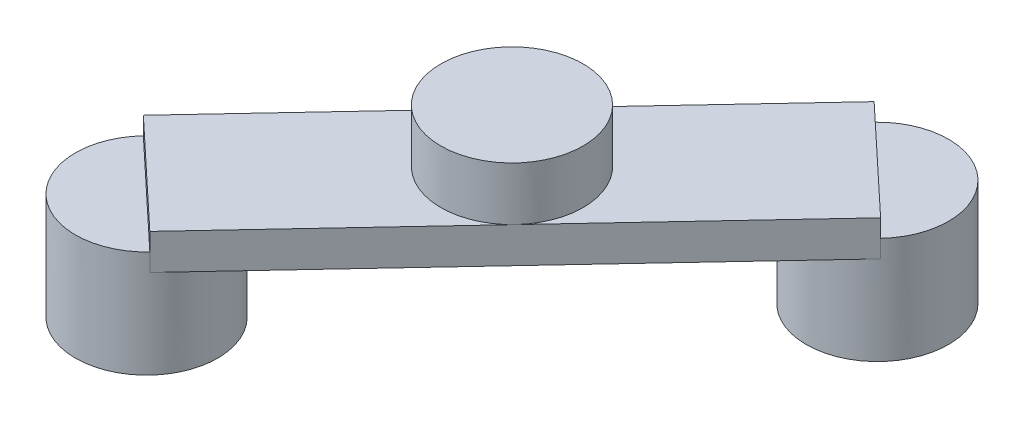
ISO-10303-21;
HEADER;
FILE_DESCRIPTION(('STEP AP214'),'2;1');
FILE_NAME('part.step','',(''),(''),'','','');
FILE_SCHEMA(('AUTOMOTIVE_DESIGN { 1 0 10303 214 1 1 1 1 }'));
ENDSEC;
DATA;
#1=APPLICATION_CONTEXT('core data for automotive mechanical design processes');
#2=APPLICATION_PROTOCOL_DEFINITION('international standard','automotive_design',2000,#1);
#3=PRODUCT_CONTEXT('',#1,'mechanical');
#4=PRODUCT('Part','Part','',(#3));
#5=PRODUCT_RELATED_PRODUCT_CATEGORY('part','',(#4));
#6=PRODUCT_DEFINITION_FORMATION('','',#4);
#7=PRODUCT_DEFINITION_CONTEXT('part definition',#1,'design');
#8=PRODUCT_DEFINITION('design','',#6,#7);
#9=PRODUCT_DEFINITION_SHAPE('','',#8);
#10=(LENGTH_UNIT() NAMED_UNIT(*) SI_UNIT(.MILLI.,.METRE.));
#11=(NAMED_UNIT(*) PLANE_ANGLE_UNIT() SI_UNIT($,.RADIAN.));
#12=(NAMED_UNIT(*) SI_UNIT($,.STERADIAN.) SOLID_ANGLE_UNIT());
#13=UNCERTAINTY_MEASURE_WITH_UNIT(LENGTH_MEASURE(1.E-05),#10,'distance_accuracy_value','');
#14=(GEOMETRIC_REPRESENTATION_CONTEXT(3) GLOBAL_UNCERTAINTY_ASSIGNED_CONTEXT((#13)) GLOBAL_UNIT_ASSIGNED_CONTEXT((#10,
#11,#12)) REPRESENTATION_CONTEXT('',''));
#15=CARTESIAN_POINT('',(0.,0.,0.));
#16=DIRECTION('',(0.,0.,1.));
#17=DIRECTION('',(1.,0.,0.));
#18=AXIS2_PLACEMENT_3D('',#15,#16,#17);
#19=CARTESIAN_POINT('',(5.83632711133455,3.5,5.47149758745276));
#20=DIRECTION('',(0.,-1.,0.));
#21=DIRECTION('',(0.,0.,-1.));
#22=AXIS2_PLACEMENT_3D('',#19,#20,#21);
#23=PLANE('',#22);
#24=CARTESIAN_POINT('',(7.29540888916818,3.5,6.83937198431596));
#25=DIRECTION('',(0.,1.,0.));
#26=DIRECTION('',(0.,0.,1.));
#27=AXIS2_PLACEMENT_3D('',#24,#25,#26);
#28=CIRCLE('',#27,2.);
#29=CARTESIAN_POINT('',(8.75449066700181,3.5,8.20724638117915));
#30=VERTEX_POINT('',#29);
#31=CARTESIAN_POINT('',(5.83632711133454,3.5,5.47149758745277));
#32=VERTEX_POINT('',#31);
#33=EDGE_CURVE('E47',#30,#32,#28,.T.);
#34=ORIENTED_EDGE('',*,*,#33,.F.);
#35=DIRECTION('',(0.683937198431595,0.,-0.729540888916818));
#36=VECTOR('',#35,1.);
#37=CARTESIAN_POINT('',(8.75449066700182,3.5,8.20724638117914));
#38=LINE('',#37,#36);
#39=CARTESIAN_POINT('',(13.7235852784558,3.5,2.90682156401012));
#40=VERTEX_POINT('',#39);
#41=EDGE_CURVE('E104',#30,#40,#38,.T.);
#42=ORIENTED_EDGE('',*,*,#41,.T.);
#43=DIRECTION('',(0.729540888916818,0.,0.683937198431595));
#44=VECTOR('',#43,1.);
#45=CARTESIAN_POINT('',(10.8054217227885,3.5,0.171072770283742));
#46=LINE('',#45,#44);
#47=CARTESIAN_POINT('',(10.8054217227885,3.5,0.171072770283742));
#48=VERTEX_POINT('',#47);
#49=EDGE_CURVE('E182',#48,#40,#46,.T.);
#50=ORIENTED_EDGE('',*,*,#49,.F.);
#51=DIRECTION('',(0.683937198431595,0.,-0.729540888916818));
#52=VECTOR('',#51,1.);
#53=CARTESIAN_POINT('',(5.83632711133455,3.5,5.47149758745276));
#54=LINE('',#53,#52);
#55=EDGE_CURVE('E117',#32,#48,#54,.T.);
#56=ORIENTED_EDGE('',*,*,#55,.F.);
#57=EDGE_LOOP('',(#34,#42,#50,#56));
#58=FACE_BOUND('',#57,.T.);
#59=ADVANCED_FACE('F37',(#58),#23,.F.);
#60=CARTESIAN_POINT('',(2.32631427771423,3.,12.139796801485));
#61=DIRECTION('',(0.,-1.,0.));
#62=DIRECTION('',(0.,0.,-1.));
#63=AXIS2_PLACEMENT_3D('',#60,#61,#62);
#64=CYLINDRICAL_SURFACE('',#63,2.);
#65=CARTESIAN_POINT('',(2.32631427771423,0.,12.139796801485));
#66=DIRECTION('',(0.,1.,0.));
#67=DIRECTION('',(0.,0.,1.));
#68=AXIS2_PLACEMENT_3D('',#65,#66,#67);
#69=CIRCLE('',#68,2.);
#70=CARTESIAN_POINT('',(2.32631427771423,0.,14.139796801485));
#71=VERTEX_POINT('',#70);
#72=EDGE_CURVE('E177',#71,#71,#69,.T.);
#73=ORIENTED_EDGE('',*,*,#72,.T.);
#74=EDGE_LOOP('',(#73));
#75=FACE_BOUND('',#74,.T.);
#76=DIRECTION('',(0.,1.,0.));
#77=VECTOR('',#76,1.);
#78=CARTESIAN_POINT('',(0.867232499880593,0.,10.7719224046218));
#79=LINE('',#78,#77);
#80=CARTESIAN_POINT('',(0.867232499880594,2.5,10.7719224046218));
#81=VERTEX_POINT('',#80);
#82=CARTESIAN_POINT('',(0.867232499880594,3.,10.7719224046218));
#83=VERTEX_POINT('',#82);
#84=EDGE_CURVE('E200',#81,#83,#79,.T.);
#85=ORIENTED_EDGE('',*,*,#84,.F.);
#86=CARTESIAN_POINT('',(2.32631427771423,2.5,12.139796801485));
#87=DIRECTION('',(0.,-1.,0.));
#88=DIRECTION('',(0.,0.,-1.));
#89=AXIS2_PLACEMENT_3D('',#86,#87,#88);
#90=CIRCLE('',#89,2.);
#91=CARTESIAN_POINT('',(3.78539605554787,2.5,13.5076711983482));
#92=VERTEX_POINT('',#91);
#93=EDGE_CURVE('E41',#81,#92,#90,.T.);
#94=ORIENTED_EDGE('',*,*,#93,.T.);
#95=DIRECTION('',(0.,1.,0.));
#96=VECTOR('',#95,1.);
#97=CARTESIAN_POINT('',(3.78539605554787,0.,13.5076711983482));
#98=LINE('',#97,#96);
#99=CARTESIAN_POINT('',(3.78539605554787,3.,13.5076711983482));
#100=VERTEX_POINT('',#99);
#101=EDGE_CURVE('E190',#92,#100,#98,.T.);
#102=ORIENTED_EDGE('',*,*,#101,.T.);
#103=CARTESIAN_POINT('',(2.32631427771423,3.,12.139796801485));
#104=DIRECTION('',(0.,1.,0.));
#105=DIRECTION('',(0.,0.,1.));
#106=AXIS2_PLACEMENT_3D('',#103,#104,#105);
#107=CIRCLE('',#106,2.);
#108=EDGE_CURVE('E172',#83,#100,#107,.T.);
#109=ORIENTED_EDGE('',*,*,#108,.F.);
#110=EDGE_LOOP('',(#85,#94,#102,#109));
#111=FACE_BOUND('',#110,.T.);
#112=ADVANCED_FACE('F39',(#75,#111),#64,.T.);
#113=CARTESIAN_POINT('',(0.,3.,0.));
#114=DIRECTION('',(0.,1.,0.));
#115=DIRECTION('',(0.,0.,1.));
#116=AXIS2_PLACEMENT_3D('',#113,#114,#115);
#117=PLANE('',#116);
#118=ORIENTED_EDGE('',*,*,#108,.T.);
#119=DIRECTION('',(-0.729540888916818,0.,-0.683937198431595));
#120=VECTOR('',#119,1.);
#121=CARTESIAN_POINT('',(-4.96909461145395,3.,5.30042481716903));
#122=LINE('',#121,#120);
#123=EDGE_CURVE('E173',#100,#83,#122,.T.);
#124=ORIENTED_EDGE('',*,*,#123,.T.);
#125=EDGE_LOOP('',(#118,#124));
#126=FACE_BOUND('',#125,.T.);
#127=ADVANCED_FACE('F143',(#126),#117,.T.);
#128=CARTESIAN_POINT('',(0.,0.,0.));
#129=DIRECTION('',(0.,1.,0.));
#130=DIRECTION('',(0.,0.,1.));
#131=AXIS2_PLACEMENT_3D('',#128,#129,#130);
#132=PLANE('',#131);
#133=ORIENTED_EDGE('',*,*,#72,.F.);
#134=EDGE_LOOP('',(#133));
#135=FACE_BOUND('',#134,.T.);
#136=ADVANCED_FACE('F156',(#135),#132,.F.);
#137=CARTESIAN_POINT('',(0.867232499880593,0.,10.7719224046218));
#138=DIRECTION('',(0.683937198431595,0.,-0.729540888916818));
#139=DIRECTION('',(-0.729540888916818,0.,-0.683937198431595));
#140=AXIS2_PLACEMENT_3D('',#137,#138,#139);
#141=PLANE('',#140);
#142=ORIENTED_EDGE('',*,*,#123,.F.);
#143=CARTESIAN_POINT('',(3.78539605554787,3.5,13.5076711983482));
#144=VERTEX_POINT('',#143);
#145=EDGE_CURVE('E192',#100,#144,#98,.T.);
#146=ORIENTED_EDGE('',*,*,#145,.T.);
#147=DIRECTION('',(0.729540888916818,0.,0.683937198431595));
#148=VECTOR('',#147,1.);
#149=CARTESIAN_POINT('',(0.867232499880593,3.5,10.7719224046218));
#150=LINE('',#149,#148);
#151=CARTESIAN_POINT('',(0.867232499880593,3.5,10.7719224046218));
#152=VERTEX_POINT('',#151);
#153=EDGE_CURVE('E100',#152,#144,#150,.T.);
#154=ORIENTED_EDGE('',*,*,#153,.F.);
#155=EDGE_CURVE('E103',#83,#152,#79,.T.);
#156=ORIENTED_EDGE('',*,*,#155,.F.);
#157=EDGE_LOOP('',(#142,#146,#154,#156));
#158=FACE_BOUND('',#157,.T.);
#159=ADVANCED_FACE('F149',(#158),#141,.F.);
#160=EDGE_CURVE('E11',#32,#30,#28,.T.);
#161=ORIENTED_EDGE('',*,*,#160,.F.);
#162=EDGE_CURVE('E184',#152,#32,#54,.T.);
#163=ORIENTED_EDGE('',*,*,#162,.F.);
#164=ORIENTED_EDGE('',*,*,#153,.T.);
#165=EDGE_CURVE('E96',#144,#30,#38,.T.);
#166=ORIENTED_EDGE('',*,*,#165,.T.);
#167=EDGE_LOOP('',(#161,#163,#164,#166));
#168=FACE_BOUND('',#167,.T.);
#169=ADVANCED_FACE('F98',(#168),#23,.F.);
#170=CARTESIAN_POINT('',(10.8054217227885,0.,0.171072770283743));
#171=DIRECTION('',(0.683937198431595,0.,-0.729540888916818));
#172=DIRECTION('',(-0.729540888916818,0.,-0.683937198431595));
#173=AXIS2_PLACEMENT_3D('',#170,#171,#172);
#174=PLANE('',#173);
#175=DIRECTION('',(0.729540888916818,0.,0.683937198431595));
#176=VECTOR('',#175,1.);
#177=CARTESIAN_POINT('',(10.8054217227885,3.,0.171072770283743));
#178=LINE('',#177,#176);
#179=CARTESIAN_POINT('',(10.8054217227885,3.,0.171072770283739));
#180=VERTEX_POINT('',#179);
#181=CARTESIAN_POINT('',(13.7235852784558,3.,2.90682156401012));
#182=VERTEX_POINT('',#181);
#183=EDGE_CURVE('E205',#180,#182,#178,.T.);
#184=ORIENTED_EDGE('',*,*,#183,.F.);
#185=DIRECTION('',(0.,1.,0.));
#186=VECTOR('',#185,1.);
#187=CARTESIAN_POINT('',(10.8054217227885,0.,0.171072770283743));
#188=LINE('',#187,#186);
#189=EDGE_CURVE('E196',#180,#48,#188,.T.);
#190=ORIENTED_EDGE('',*,*,#189,.T.);
#191=ORIENTED_EDGE('',*,*,#49,.T.);
#192=DIRECTION('',(0.,1.,0.));
#193=VECTOR('',#192,1.);
#194=CARTESIAN_POINT('',(13.7235852784558,0.,2.90682156401012));
#195=LINE('',#194,#193);
#196=EDGE_CURVE('E111',#182,#40,#195,.T.);
#197=ORIENTED_EDGE('',*,*,#196,.F.);
#198=EDGE_LOOP('',(#184,#190,#191,#197));
#199=FACE_BOUND('',#198,.T.);
#200=ADVANCED_FACE('F148',(#199),#174,.T.);
#201=CARTESIAN_POINT('',(5.83632711133455,2.5,5.47149758745276));
#202=DIRECTION('',(0.,-1.,0.));
#203=DIRECTION('',(0.,0.,-1.));
#204=AXIS2_PLACEMENT_3D('',#201,#202,#203);
#205=PLANE('',#204);
#206=DIRECTION('',(0.683937198431595,0.,-0.729540888916818));
#207=VECTOR('',#206,1.);
#208=CARTESIAN_POINT('',(5.83632711133455,2.5,5.47149758745276));
#209=LINE('',#208,#207);
#210=CARTESIAN_POINT('',(10.8054217227885,2.5,0.171072770283741));
#211=VERTEX_POINT('',#210);
#212=EDGE_CURVE('E197',#81,#211,#209,.T.);
#213=ORIENTED_EDGE('',*,*,#212,.T.);
#214=CARTESIAN_POINT('',(12.2645035006221,2.5,1.53894716714693));
#215=DIRECTION('',(0.,-1.,0.));
#216=DIRECTION('',(0.,0.,-1.));
#217=AXIS2_PLACEMENT_3D('',#214,#215,#216);
#218=CIRCLE('',#217,2.);
#219=CARTESIAN_POINT('',(13.7235852784558,2.5,2.90682156401012));
#220=VERTEX_POINT('',#219);
#221=EDGE_CURVE('E202',#211,#220,#218,.F.);
#222=ORIENTED_EDGE('',*,*,#221,.T.);
#223=DIRECTION('',(0.683937198431595,0.,-0.729540888916818));
#224=VECTOR('',#223,1.);
#225=CARTESIAN_POINT('',(8.75449066700182,2.5,8.20724638117914));
#226=LINE('',#225,#224);
#227=EDGE_CURVE('E187',#92,#220,#226,.T.);
#228=ORIENTED_EDGE('',*,*,#227,.F.);
#229=ORIENTED_EDGE('',*,*,#93,.F.);
#230=EDGE_LOOP('',(#213,#222,#228,#229));
#231=FACE_BOUND('',#230,.T.);
#232=ADVANCED_FACE('F154',(#231),#205,.T.);
#233=CARTESIAN_POINT('',(5.83632711133455,0.,5.47149758745276));
#234=DIRECTION('',(0.729540888916818,0.,0.683937198431595));
#235=DIRECTION('',(0.683937198431595,0.,-0.729540888916818));
#236=AXIS2_PLACEMENT_3D('',#233,#234,#235);
#237=PLANE('',#236);
#238=ORIENTED_EDGE('',*,*,#84,.T.);
#239=ORIENTED_EDGE('',*,*,#155,.T.);
#240=ORIENTED_EDGE('',*,*,#162,.T.);
#241=ORIENTED_EDGE('',*,*,#55,.T.);
#242=ORIENTED_EDGE('',*,*,#189,.F.);
#243=EDGE_CURVE('E194',#211,#180,#188,.T.);
#244=ORIENTED_EDGE('',*,*,#243,.F.);
#245=ORIENTED_EDGE('',*,*,#212,.F.);
#246=EDGE_LOOP('',(#238,#239,#240,#241,#242,#244,#245));
#247=FACE_BOUND('',#246,.T.);
#248=ADVANCED_FACE('F218',(#247),#237,.F.);
#249=CARTESIAN_POINT('',(8.75449066700182,0.,8.20724638117914));
#250=DIRECTION('',(0.729540888916818,0.,0.683937198431595));
#251=DIRECTION('',(0.683937198431595,0.,-0.729540888916818));
#252=AXIS2_PLACEMENT_3D('',#249,#250,#251);
#253=PLANE('',#252);
#254=ORIENTED_EDGE('',*,*,#101,.F.);
#255=ORIENTED_EDGE('',*,*,#227,.T.);
#256=EDGE_CURVE('E115',#220,#182,#195,.T.);
#257=ORIENTED_EDGE('',*,*,#256,.T.);
#258=ORIENTED_EDGE('',*,*,#196,.T.);
#259=ORIENTED_EDGE('',*,*,#41,.F.);
#260=ORIENTED_EDGE('',*,*,#165,.F.);
#261=ORIENTED_EDGE('',*,*,#145,.F.);
#262=EDGE_LOOP('',(#254,#255,#257,#258,#259,#260,#261));
#263=FACE_BOUND('',#262,.T.);
#264=ADVANCED_FACE('F108',(#263),#253,.T.);
#265=CARTESIAN_POINT('',(12.2645035006221,3.,1.53894716714693));
#266=DIRECTION('',(0.,-1.,0.));
#267=DIRECTION('',(0.,0.,-1.));
#268=AXIS2_PLACEMENT_3D('',#265,#266,#267);
#269=CYLINDRICAL_SURFACE('',#268,2.);
#270=ORIENTED_EDGE('',*,*,#243,.T.);
#271=CARTESIAN_POINT('',(12.2645035006221,3.,1.53894716714693));
#272=DIRECTION('',(0.,1.,0.));
#273=DIRECTION('',(0.,0.,1.));
#274=AXIS2_PLACEMENT_3D('',#271,#272,#273);
#275=CIRCLE('',#274,2.);
#276=EDGE_CURVE('E60',#182,#180,#275,.T.);
#277=ORIENTED_EDGE('',*,*,#276,.F.);
#278=ORIENTED_EDGE('',*,*,#256,.F.);
#279=ORIENTED_EDGE('',*,*,#221,.F.);
#280=EDGE_LOOP('',(#270,#277,#278,#279));
#281=FACE_BOUND('',#280,.T.);
#282=CARTESIAN_POINT('',(12.2645035006221,0.,1.53894716714693));
#283=DIRECTION('',(0.,1.,0.));
#284=DIRECTION('',(0.,0.,1.));
#285=AXIS2_PLACEMENT_3D('',#282,#283,#284);
#286=CIRCLE('',#285,2.);
#287=CARTESIAN_POINT('',(12.2645035006221,0.,3.53894716714693));
#288=VERTEX_POINT('',#287);
#289=EDGE_CURVE('E207',#288,#288,#286,.T.);
#290=ORIENTED_EDGE('',*,*,#289,.T.);
#291=EDGE_LOOP('',(#290));
#292=FACE_BOUND('',#291,.T.);
#293=ADVANCED_FACE('F224',(#281,#292),#269,.T.);
#294=CARTESIAN_POINT('',(0.,3.,0.));
#295=DIRECTION('',(0.,1.,0.));
#296=DIRECTION('',(0.,0.,1.));
#297=AXIS2_PLACEMENT_3D('',#294,#295,#296);
#298=PLANE('',#297);
#299=ORIENTED_EDGE('',*,*,#276,.T.);
#300=ORIENTED_EDGE('',*,*,#183,.T.);
#301=EDGE_LOOP('',(#299,#300));
#302=FACE_BOUND('',#301,.T.);
#303=ADVANCED_FACE('F133',(#302),#298,.T.);
#304=CARTESIAN_POINT('',(0.,0.,0.));
#305=DIRECTION('',(0.,1.,0.));
#306=DIRECTION('',(0.,0.,1.));
#307=AXIS2_PLACEMENT_3D('',#304,#305,#306);
#308=PLANE('',#307);
#309=ORIENTED_EDGE('',*,*,#289,.F.);
#310=EDGE_LOOP('',(#309));
#311=FACE_BOUND('',#310,.T.);
#312=ADVANCED_FACE('F124',(#311),#308,.F.);
#313=CARTESIAN_POINT('',(7.29540888916818,5.,6.83937198431596));
#314=DIRECTION('',(0.,-1.,0.));
#315=DIRECTION('',(0.,0.,-1.));
#316=AXIS2_PLACEMENT_3D('',#313,#314,#315);
#317=CYLINDRICAL_SURFACE('',#316,2.);
#318=CARTESIAN_POINT('',(7.29540888916818,5.,6.83937198431596));
#319=DIRECTION('',(0.,1.,0.));
#320=DIRECTION('',(0.,0.,1.));
#321=AXIS2_PLACEMENT_3D('',#318,#319,#320);
#322=CIRCLE('',#321,2.);
#323=CARTESIAN_POINT('',(7.29540888916818,5.,8.83937198431596));
#324=VERTEX_POINT('',#323);
#325=EDGE_CURVE('E120',#324,#324,#322,.T.);
#326=ORIENTED_EDGE('',*,*,#325,.F.);
#327=EDGE_LOOP('',(#326));
#328=FACE_BOUND('',#327,.T.);
#329=ORIENTED_EDGE('',*,*,#33,.T.);
#330=ORIENTED_EDGE('',*,*,#160,.T.);
#331=EDGE_LOOP('',(#329,#330));
#332=FACE_BOUND('',#331,.T.);
#333=ADVANCED_FACE('F121',(#328,#332),#317,.T.);
#334=CARTESIAN_POINT('',(0.,5.,0.));
#335=DIRECTION('',(0.,1.,0.));
#336=DIRECTION('',(0.,0.,1.));
#337=AXIS2_PLACEMENT_3D('',#334,#335,#336);
#338=PLANE('',#337);
#339=ORIENTED_EDGE('',*,*,#325,.T.);
#340=EDGE_LOOP('',(#339));
#341=FACE_BOUND('',#340,.T.);
#342=ADVANCED_FACE('F123',(#341),#338,.T.);
#343=CLOSED_SHELL('',(#59,#112,#127,#136,#159,#169,#200,#232,#248,#264,#293,#303,#312,#333,#342));
#344=MANIFOLD_SOLID_BREP('B2',#343);
#345=ADVANCED_BREP_SHAPE_REPRESENTATION('',(#18,#344),#14);
#346=SHAPE_DEFINITION_REPRESENTATION(#9,#345);
ENDSEC;
END-ISO-10303-21;
